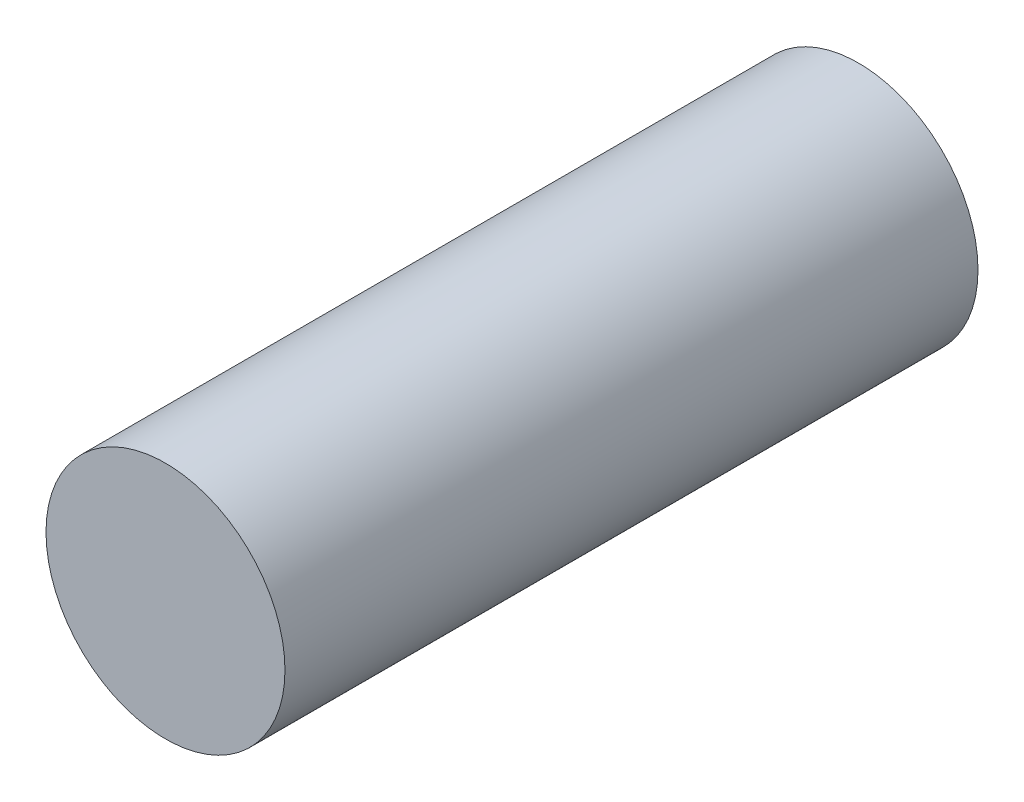
ISO-10303-21;
HEADER;
FILE_DESCRIPTION(('STEP AP214'),'2;1');
FILE_NAME('part.step','',(''),(''),'','','');
FILE_SCHEMA(('AUTOMOTIVE_DESIGN { 1 0 10303 214 1 1 1 1 }'));
ENDSEC;
DATA;
#1=APPLICATION_CONTEXT('core data for automotive mechanical design processes');
#2=APPLICATION_PROTOCOL_DEFINITION('international standard','automotive_design',2000,#1);
#3=PRODUCT_CONTEXT('',#1,'mechanical');
#4=PRODUCT('Part','Part','',(#3));
#5=PRODUCT_RELATED_PRODUCT_CATEGORY('part','',(#4));
#6=PRODUCT_DEFINITION_FORMATION('','',#4);
#7=PRODUCT_DEFINITION_CONTEXT('part definition',#1,'design');
#8=PRODUCT_DEFINITION('design','',#6,#7);
#9=PRODUCT_DEFINITION_SHAPE('','',#8);
#10=(LENGTH_UNIT() NAMED_UNIT(*) SI_UNIT(.MILLI.,.METRE.));
#11=(NAMED_UNIT(*) PLANE_ANGLE_UNIT() SI_UNIT($,.RADIAN.));
#12=(NAMED_UNIT(*) SI_UNIT($,.STERADIAN.) SOLID_ANGLE_UNIT());
#13=UNCERTAINTY_MEASURE_WITH_UNIT(LENGTH_MEASURE(1.E-05),#10,'distance_accuracy_value','');
#14=(GEOMETRIC_REPRESENTATION_CONTEXT(3) GLOBAL_UNCERTAINTY_ASSIGNED_CONTEXT((#13)) GLOBAL_UNIT_ASSIGNED_CONTEXT((#10,
#11,#12)) REPRESENTATION_CONTEXT('',''));
#15=CARTESIAN_POINT('',(0.,0.,0.));
#16=DIRECTION('',(0.,0.,1.));
#17=DIRECTION('',(1.,0.,0.));
#18=AXIS2_PLACEMENT_3D('',#15,#16,#17);
#19=CARTESIAN_POINT('',(0.,0.,29.));
#20=DIRECTION('',(0.,0.,-1.));
#21=DIRECTION('',(-1.,0.,0.));
#22=AXIS2_PLACEMENT_3D('',#19,#20,#21);
#23=CYLINDRICAL_SURFACE('',#22,5.);
#24=CARTESIAN_POINT('',(0.,0.,29.));
#25=DIRECTION('',(0.,0.,1.));
#26=DIRECTION('',(1.,0.,0.));
#27=AXIS2_PLACEMENT_3D('',#24,#25,#26);
#28=CIRCLE('',#27,5.);
#29=CARTESIAN_POINT('',(5.,0.,29.));
#30=VERTEX_POINT('',#29);
#31=EDGE_CURVE('E10',#30,#30,#28,.T.);
#32=ORIENTED_EDGE('',*,*,#31,.F.);
#33=EDGE_LOOP('',(#32));
#34=FACE_BOUND('',#33,.T.);
#35=CARTESIAN_POINT('',(0.,0.,0.));
#36=DIRECTION('',(0.,0.,1.));
#37=DIRECTION('',(1.,0.,0.));
#38=AXIS2_PLACEMENT_3D('',#35,#36,#37);
#39=CIRCLE('',#38,5.);
#40=CARTESIAN_POINT('',(5.,0.,0.));
#41=VERTEX_POINT('',#40);
#42=EDGE_CURVE('E42',#41,#41,#39,.T.);
#43=ORIENTED_EDGE('',*,*,#42,.T.);
#44=EDGE_LOOP('',(#43));
#45=FACE_BOUND('',#44,.T.);
#46=ADVANCED_FACE('F39',(#34,#45),#23,.T.);
#47=CARTESIAN_POINT('',(0.,0.,29.));
#48=DIRECTION('',(0.,0.,1.));
#49=DIRECTION('',(1.,0.,0.));
#50=AXIS2_PLACEMENT_3D('',#47,#48,#49);
#51=PLANE('',#50);
#52=ORIENTED_EDGE('',*,*,#31,.T.);
#53=EDGE_LOOP('',(#52));
#54=FACE_BOUND('',#53,.T.);
#55=ADVANCED_FACE('F56',(#54),#51,.T.);
#56=CARTESIAN_POINT('',(0.,0.,0.));
#57=DIRECTION('',(0.,0.,1.));
#58=DIRECTION('',(1.,0.,0.));
#59=AXIS2_PLACEMENT_3D('',#56,#57,#58);
#60=PLANE('',#59);
#61=ORIENTED_EDGE('',*,*,#42,.F.);
#62=EDGE_LOOP('',(#61));
#63=FACE_BOUND('',#62,.T.);
#64=ADVANCED_FACE('F54',(#63),#60,.F.);
#65=CLOSED_SHELL('',(#46,#55,#64));
#66=MANIFOLD_SOLID_BREP('B2',#65);
#67=ADVANCED_BREP_SHAPE_REPRESENTATION('',(#18,#66),#14);
#68=SHAPE_DEFINITION_REPRESENTATION(#9,#67);
ENDSEC;
END-ISO-10303-21;
